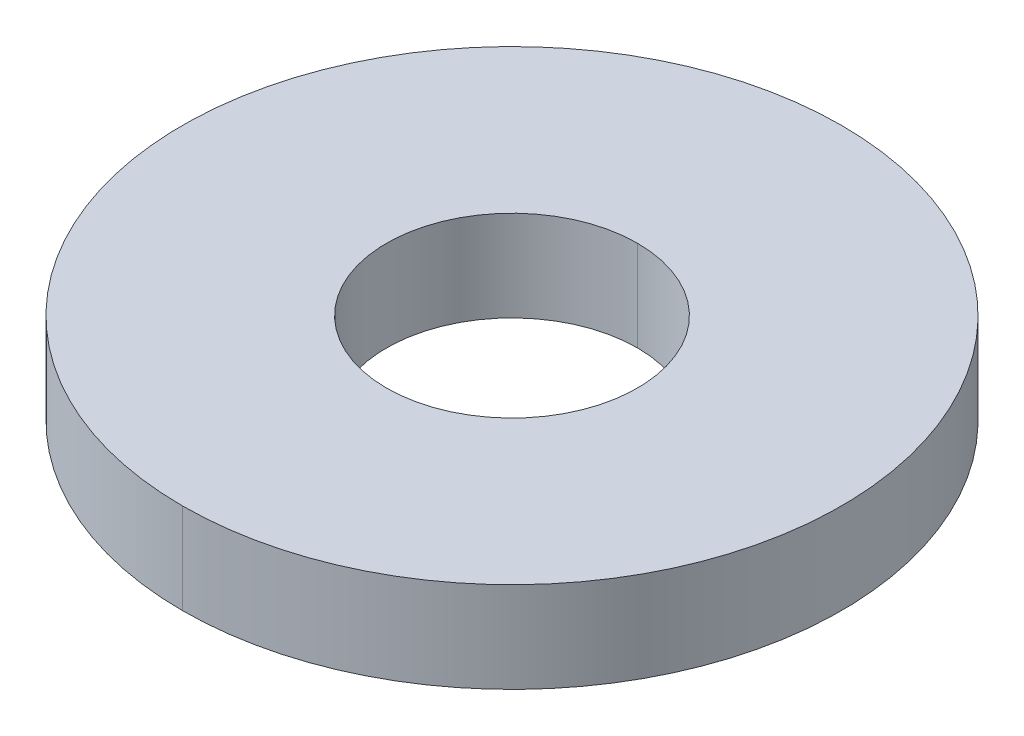
ISO-10303-21;
HEADER;
FILE_DESCRIPTION(('STEP AP214'),'2;1');
FILE_NAME('part.step','',(''),(''),'','','');
FILE_SCHEMA(('AUTOMOTIVE_DESIGN { 1 0 10303 214 1 1 1 1 }'));
ENDSEC;
DATA;
#1=APPLICATION_CONTEXT('core data for automotive mechanical design processes');
#2=APPLICATION_PROTOCOL_DEFINITION('international standard','automotive_design',2000,#1);
#3=PRODUCT_CONTEXT('',#1,'mechanical');
#4=PRODUCT('Part','Part','',(#3));
#5=PRODUCT_RELATED_PRODUCT_CATEGORY('part','',(#4));
#6=PRODUCT_DEFINITION_FORMATION('','',#4);
#7=PRODUCT_DEFINITION_CONTEXT('part definition',#1,'design');
#8=PRODUCT_DEFINITION('design','',#6,#7);
#9=PRODUCT_DEFINITION_SHAPE('','',#8);
#10=(LENGTH_UNIT() NAMED_UNIT(*) SI_UNIT(.MILLI.,.METRE.));
#11=(NAMED_UNIT(*) PLANE_ANGLE_UNIT() SI_UNIT($,.RADIAN.));
#12=(NAMED_UNIT(*) SI_UNIT($,.STERADIAN.) SOLID_ANGLE_UNIT());
#13=UNCERTAINTY_MEASURE_WITH_UNIT(LENGTH_MEASURE(1.E-05),#10,'distance_accuracy_value','');
#14=(GEOMETRIC_REPRESENTATION_CONTEXT(3) GLOBAL_UNCERTAINTY_ASSIGNED_CONTEXT((#13)) GLOBAL_UNIT_ASSIGNED_CONTEXT((#10,
#11,#12)) REPRESENTATION_CONTEXT('',''));
#15=CARTESIAN_POINT('',(0.,0.,0.));
#16=DIRECTION('',(0.,0.,1.));
#17=DIRECTION('',(1.,0.,0.));
#18=AXIS2_PLACEMENT_3D('',#15,#16,#17);
#19=CARTESIAN_POINT('',(0.,1.5,0.));
#20=DIRECTION('',(0.,-1.,0.));
#21=DIRECTION('',(0.,0.,-1.));
#22=AXIS2_PLACEMENT_3D('',#19,#20,#21);
#23=CYLINDRICAL_SURFACE('',#22,2.075);
#24=DIRECTION('',(0.,-1.,0.));
#25=VECTOR('',#24,1.);
#26=CARTESIAN_POINT('',(0.,1.5,2.075));
#27=LINE('',#26,#25);
#28=CARTESIAN_POINT('',(0.,1.5,2.075));
#29=VERTEX_POINT('',#28);
#30=CARTESIAN_POINT('',(0.,0.,2.075));
#31=VERTEX_POINT('',#30);
#32=EDGE_CURVE('E120',#29,#31,#27,.T.);
#33=ORIENTED_EDGE('',*,*,#32,.F.);
#34=CARTESIAN_POINT('',(0.,1.5,0.));
#35=DIRECTION('',(0.,1.,0.));
#36=DIRECTION('',(0.,0.,1.));
#37=AXIS2_PLACEMENT_3D('',#34,#35,#36);
#38=CIRCLE('',#37,2.075);
#39=CARTESIAN_POINT('',(0.,1.5,-2.075));
#40=VERTEX_POINT('',#39);
#41=EDGE_CURVE('E58',#29,#40,#38,.T.);
#42=ORIENTED_EDGE('',*,*,#41,.T.);
#43=DIRECTION('',(0.,-1.,0.));
#44=VECTOR('',#43,1.);
#45=CARTESIAN_POINT('',(0.,1.5,-2.075));
#46=LINE('',#45,#44);
#47=CARTESIAN_POINT('',(0.,0.,-2.075));
#48=VERTEX_POINT('',#47);
#49=EDGE_CURVE('E100',#40,#48,#46,.T.);
#50=ORIENTED_EDGE('',*,*,#49,.T.);
#51=CARTESIAN_POINT('',(0.,0.,0.));
#52=DIRECTION('',(0.,1.,0.));
#53=DIRECTION('',(0.,0.,1.));
#54=AXIS2_PLACEMENT_3D('',#51,#52,#53);
#55=CIRCLE('',#54,2.075);
#56=EDGE_CURVE('E10',#31,#48,#55,.T.);
#57=ORIENTED_EDGE('',*,*,#56,.F.);
#58=EDGE_LOOP('',(#33,#42,#50,#57));
#59=FACE_BOUND('',#58,.T.);
#60=ADVANCED_FACE('F15',(#59),#23,.F.);
#61=CARTESIAN_POINT('',(0.,1.5,0.));
#62=DIRECTION('',(0.,-1.,0.));
#63=DIRECTION('',(0.,0.,-1.));
#64=AXIS2_PLACEMENT_3D('',#61,#62,#63);
#65=CYLINDRICAL_SURFACE('',#64,5.45);
#66=DIRECTION('',(0.,-1.,0.));
#67=VECTOR('',#66,1.);
#68=CARTESIAN_POINT('',(0.,1.5,5.45));
#69=LINE('',#68,#67);
#70=CARTESIAN_POINT('',(0.,1.5,5.45));
#71=VERTEX_POINT('',#70);
#72=CARTESIAN_POINT('',(0.,0.,5.45));
#73=VERTEX_POINT('',#72);
#74=EDGE_CURVE('E91',#71,#73,#69,.T.);
#75=ORIENTED_EDGE('',*,*,#74,.F.);
#76=CARTESIAN_POINT('',(0.,1.5,0.));
#77=DIRECTION('',(0.,1.,0.));
#78=DIRECTION('',(0.,0.,1.));
#79=AXIS2_PLACEMENT_3D('',#76,#77,#78);
#80=CIRCLE('',#79,5.45);
#81=CARTESIAN_POINT('',(0.,1.5,-5.45));
#82=VERTEX_POINT('',#81);
#83=EDGE_CURVE('E77',#82,#71,#80,.T.);
#84=ORIENTED_EDGE('',*,*,#83,.F.);
#85=DIRECTION('',(0.,-1.,0.));
#86=VECTOR('',#85,1.);
#87=CARTESIAN_POINT('',(0.,1.5,-5.45));
#88=LINE('',#87,#86);
#89=CARTESIAN_POINT('',(0.,0.,-5.45));
#90=VERTEX_POINT('',#89);
#91=EDGE_CURVE('E88',#82,#90,#88,.T.);
#92=ORIENTED_EDGE('',*,*,#91,.T.);
#93=CARTESIAN_POINT('',(0.,0.,0.));
#94=DIRECTION('',(0.,1.,0.));
#95=DIRECTION('',(0.,0.,1.));
#96=AXIS2_PLACEMENT_3D('',#93,#94,#95);
#97=CIRCLE('',#96,5.45);
#98=EDGE_CURVE('E26',#90,#73,#97,.T.);
#99=ORIENTED_EDGE('',*,*,#98,.T.);
#100=EDGE_LOOP('',(#75,#84,#92,#99));
#101=FACE_BOUND('',#100,.T.);
#102=ADVANCED_FACE('F92',(#101),#65,.T.);
#103=CARTESIAN_POINT('',(0.,0.,0.));
#104=DIRECTION('',(0.,1.,0.));
#105=DIRECTION('',(1.,0.,0.));
#106=AXIS2_PLACEMENT_3D('',#103,#104,#105);
#107=PLANE('',#106);
#108=CARTESIAN_POINT('',(0.,0.,0.));
#109=DIRECTION('',(0.,1.,0.));
#110=DIRECTION('',(0.,0.,1.));
#111=AXIS2_PLACEMENT_3D('',#108,#109,#110);
#112=CIRCLE('',#111,2.075);
#113=EDGE_CURVE('E107',#48,#31,#112,.T.);
#114=ORIENTED_EDGE('',*,*,#113,.T.);
#115=ORIENTED_EDGE('',*,*,#56,.T.);
#116=EDGE_LOOP('',(#114,#115));
#117=FACE_BOUND('',#116,.T.);
#118=ORIENTED_EDGE('',*,*,#98,.F.);
#119=CARTESIAN_POINT('',(0.,0.,0.));
#120=DIRECTION('',(0.,1.,0.));
#121=DIRECTION('',(0.,0.,1.));
#122=AXIS2_PLACEMENT_3D('',#119,#120,#121);
#123=CIRCLE('',#122,5.45);
#124=EDGE_CURVE('E96',#73,#90,#123,.T.);
#125=ORIENTED_EDGE('',*,*,#124,.F.);
#126=EDGE_LOOP('',(#118,#125));
#127=FACE_BOUND('',#126,.T.);
#128=ADVANCED_FACE('F130',(#117,#127),#107,.F.);
#129=CARTESIAN_POINT('',(0.,1.5,0.));
#130=DIRECTION('',(0.,1.,0.));
#131=DIRECTION('',(1.,0.,0.));
#132=AXIS2_PLACEMENT_3D('',#129,#130,#131);
#133=PLANE('',#132);
#134=CARTESIAN_POINT('',(0.,1.5,0.));
#135=DIRECTION('',(0.,1.,0.));
#136=DIRECTION('',(0.,0.,1.));
#137=AXIS2_PLACEMENT_3D('',#134,#135,#136);
#138=CIRCLE('',#137,2.075);
#139=EDGE_CURVE('E19',#40,#29,#138,.T.);
#140=ORIENTED_EDGE('',*,*,#139,.F.);
#141=ORIENTED_EDGE('',*,*,#41,.F.);
#142=EDGE_LOOP('',(#140,#141));
#143=FACE_BOUND('',#142,.T.);
#144=ORIENTED_EDGE('',*,*,#83,.T.);
#145=CARTESIAN_POINT('',(0.,1.5,0.));
#146=DIRECTION('',(0.,1.,0.));
#147=DIRECTION('',(0.,0.,1.));
#148=AXIS2_PLACEMENT_3D('',#145,#146,#147);
#149=CIRCLE('',#148,5.45);
#150=EDGE_CURVE('E86',#71,#82,#149,.T.);
#151=ORIENTED_EDGE('',*,*,#150,.T.);
#152=EDGE_LOOP('',(#144,#151));
#153=FACE_BOUND('',#152,.T.);
#154=ADVANCED_FACE('F84',(#143,#153),#133,.T.);
#155=CARTESIAN_POINT('',(0.,1.5,0.));
#156=DIRECTION('',(0.,-1.,0.));
#157=DIRECTION('',(0.,0.,-1.));
#158=AXIS2_PLACEMENT_3D('',#155,#156,#157);
#159=CYLINDRICAL_SURFACE('',#158,5.45);
#160=ORIENTED_EDGE('',*,*,#150,.F.);
#161=ORIENTED_EDGE('',*,*,#74,.T.);
#162=ORIENTED_EDGE('',*,*,#124,.T.);
#163=ORIENTED_EDGE('',*,*,#91,.F.);
#164=EDGE_LOOP('',(#160,#161,#162,#163));
#165=FACE_BOUND('',#164,.T.);
#166=ADVANCED_FACE('F98',(#165),#159,.T.);
#167=CARTESIAN_POINT('',(0.,1.5,0.));
#168=DIRECTION('',(0.,-1.,0.));
#169=DIRECTION('',(0.,0.,-1.));
#170=AXIS2_PLACEMENT_3D('',#167,#168,#169);
#171=CYLINDRICAL_SURFACE('',#170,2.075);
#172=ORIENTED_EDGE('',*,*,#139,.T.);
#173=ORIENTED_EDGE('',*,*,#32,.T.);
#174=ORIENTED_EDGE('',*,*,#113,.F.);
#175=ORIENTED_EDGE('',*,*,#49,.F.);
#176=EDGE_LOOP('',(#172,#173,#174,#175));
#177=FACE_BOUND('',#176,.T.);
#178=ADVANCED_FACE('F17',(#177),#171,.F.);
#179=CLOSED_SHELL('',(#60,#102,#128,#154,#166,#178));
#180=MANIFOLD_SOLID_BREP('B1',#179);
#181=ADVANCED_BREP_SHAPE_REPRESENTATION('',(#18,#180),#14);
#182=SHAPE_DEFINITION_REPRESENTATION(#9,#181);
ENDSEC;
END-ISO-10303-21;
